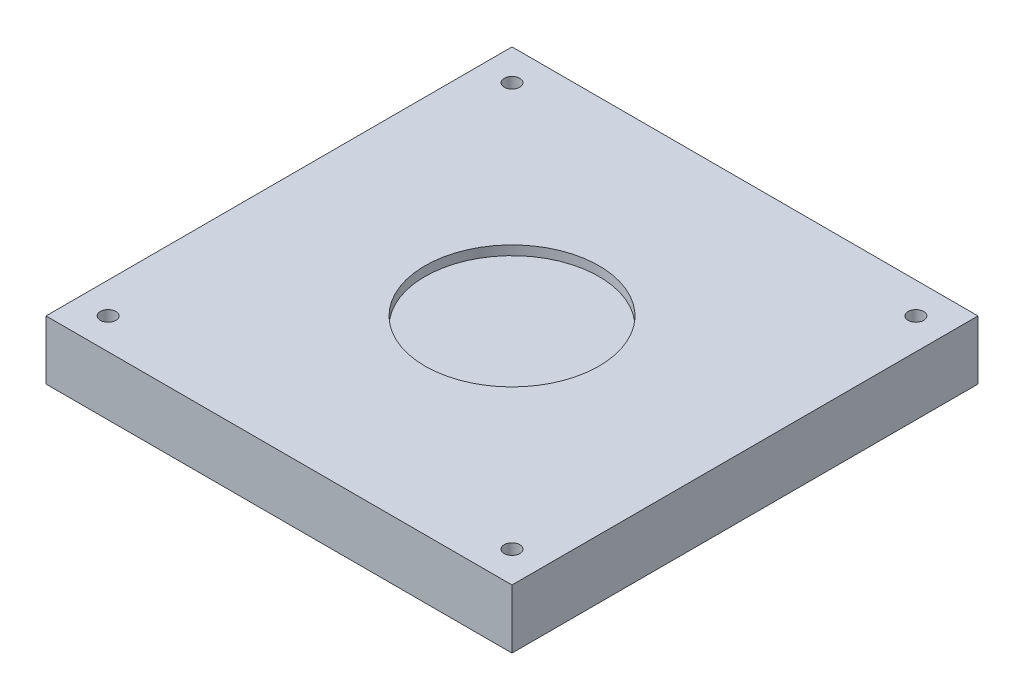
ISO-10303-21;
HEADER;
FILE_DESCRIPTION(('STEP AP214'),'2;1');
FILE_NAME('part.step','',(''),(''),'','','');
FILE_SCHEMA(('AUTOMOTIVE_DESIGN { 1 0 10303 214 1 1 1 1 }'));
ENDSEC;
DATA;
#1=APPLICATION_CONTEXT('core data for automotive mechanical design processes');
#2=APPLICATION_PROTOCOL_DEFINITION('international standard','automotive_design',2000,#1);
#3=PRODUCT_CONTEXT('',#1,'mechanical');
#4=PRODUCT('Part','Part','',(#3));
#5=PRODUCT_RELATED_PRODUCT_CATEGORY('part','',(#4));
#6=PRODUCT_DEFINITION_FORMATION('','',#4);
#7=PRODUCT_DEFINITION_CONTEXT('part definition',#1,'design');
#8=PRODUCT_DEFINITION('design','',#6,#7);
#9=PRODUCT_DEFINITION_SHAPE('','',#8);
#10=(LENGTH_UNIT() NAMED_UNIT(*) SI_UNIT(.MILLI.,.METRE.));
#11=(NAMED_UNIT(*) PLANE_ANGLE_UNIT() SI_UNIT($,.RADIAN.));
#12=(NAMED_UNIT(*) SI_UNIT($,.STERADIAN.) SOLID_ANGLE_UNIT());
#13=UNCERTAINTY_MEASURE_WITH_UNIT(LENGTH_MEASURE(1.E-05),#10,'distance_accuracy_value','');
#14=(GEOMETRIC_REPRESENTATION_CONTEXT(3) GLOBAL_UNCERTAINTY_ASSIGNED_CONTEXT((#13)) GLOBAL_UNIT_ASSIGNED_CONTEXT((#10,
#11,#12)) REPRESENTATION_CONTEXT('',''));
#15=CARTESIAN_POINT('',(0.,0.,0.));
#16=DIRECTION('',(0.,0.,1.));
#17=DIRECTION('',(1.,0.,0.));
#18=AXIS2_PLACEMENT_3D('',#15,#16,#17);
#19=CARTESIAN_POINT('',(0.,19.,0.));
#20=DIRECTION('',(1.,0.,0.));
#21=DIRECTION('',(0.,0.,-1.));
#22=AXIS2_PLACEMENT_3D('',#19,#20,#21);
#23=PLANE('',#22);
#24=DIRECTION('',(0.,0.,1.));
#25=VECTOR('',#24,1.);
#26=CARTESIAN_POINT('',(0.,0.,0.));
#27=LINE('',#26,#25);
#28=CARTESIAN_POINT('',(0.,0.,-150.));
#29=VERTEX_POINT('',#28);
#30=CARTESIAN_POINT('',(0.,0.,0.));
#31=VERTEX_POINT('',#30);
#32=EDGE_CURVE('E107',#29,#31,#27,.T.);
#33=ORIENTED_EDGE('',*,*,#32,.T.);
#34=DIRECTION('',(0.,-1.,0.));
#35=VECTOR('',#34,1.);
#36=CARTESIAN_POINT('',(0.,19.,0.));
#37=LINE('',#36,#35);
#38=CARTESIAN_POINT('',(0.,19.,0.));
#39=VERTEX_POINT('',#38);
#40=EDGE_CURVE('E11',#39,#31,#37,.T.);
#41=ORIENTED_EDGE('',*,*,#40,.F.);
#42=DIRECTION('',(0.,0.,1.));
#43=VECTOR('',#42,1.);
#44=CARTESIAN_POINT('',(0.,19.,0.));
#45=LINE('',#44,#43);
#46=CARTESIAN_POINT('',(0.,19.,-150.));
#47=VERTEX_POINT('',#46);
#48=EDGE_CURVE('E91',#47,#39,#45,.T.);
#49=ORIENTED_EDGE('',*,*,#48,.F.);
#50=DIRECTION('',(0.,-1.,0.));
#51=VECTOR('',#50,1.);
#52=CARTESIAN_POINT('',(0.,19.,-150.));
#53=LINE('',#52,#51);
#54=EDGE_CURVE('E103',#47,#29,#53,.T.);
#55=ORIENTED_EDGE('',*,*,#54,.T.);
#56=EDGE_LOOP('',(#33,#41,#49,#55));
#57=FACE_BOUND('',#56,.T.);
#58=ADVANCED_FACE('F39',(#57),#23,.F.);
#59=CARTESIAN_POINT('',(0.,19.,0.));
#60=DIRECTION('',(0.,0.,-1.));
#61=DIRECTION('',(-1.,0.,0.));
#62=AXIS2_PLACEMENT_3D('',#59,#60,#61);
#63=PLANE('',#62);
#64=DIRECTION('',(1.,0.,0.));
#65=VECTOR('',#64,1.);
#66=CARTESIAN_POINT('',(0.,0.,0.));
#67=LINE('',#66,#65);
#68=CARTESIAN_POINT('',(150.,0.,0.));
#69=VERTEX_POINT('',#68);
#70=EDGE_CURVE('E96',#31,#69,#67,.T.);
#71=ORIENTED_EDGE('',*,*,#70,.T.);
#72=DIRECTION('',(0.,-1.,0.));
#73=VECTOR('',#72,1.);
#74=CARTESIAN_POINT('',(150.,19.,0.));
#75=LINE('',#74,#73);
#76=CARTESIAN_POINT('',(150.,19.,0.));
#77=VERTEX_POINT('',#76);
#78=EDGE_CURVE('E48',#77,#69,#75,.T.);
#79=ORIENTED_EDGE('',*,*,#78,.F.);
#80=DIRECTION('',(1.,0.,0.));
#81=VECTOR('',#80,1.);
#82=CARTESIAN_POINT('',(0.,19.,0.));
#83=LINE('',#82,#81);
#84=EDGE_CURVE('E86',#39,#77,#83,.T.);
#85=ORIENTED_EDGE('',*,*,#84,.F.);
#86=ORIENTED_EDGE('',*,*,#40,.T.);
#87=EDGE_LOOP('',(#71,#79,#85,#86));
#88=FACE_BOUND('',#87,.T.);
#89=ADVANCED_FACE('F95',(#88),#63,.F.);
#90=CARTESIAN_POINT('',(150.,19.,0.));
#91=DIRECTION('',(-1.,0.,0.));
#92=DIRECTION('',(0.,0.,1.));
#93=AXIS2_PLACEMENT_3D('',#90,#91,#92);
#94=PLANE('',#93);
#95=DIRECTION('',(0.,0.,-1.));
#96=VECTOR('',#95,1.);
#97=CARTESIAN_POINT('',(150.,0.,0.));
#98=LINE('',#97,#96);
#99=CARTESIAN_POINT('',(150.,0.,-150.));
#100=VERTEX_POINT('',#99);
#101=EDGE_CURVE('E73',#69,#100,#98,.T.);
#102=ORIENTED_EDGE('',*,*,#101,.T.);
#103=DIRECTION('',(0.,-1.,0.));
#104=VECTOR('',#103,1.);
#105=CARTESIAN_POINT('',(150.,19.,-150.));
#106=LINE('',#105,#104);
#107=CARTESIAN_POINT('',(150.,19.,-150.));
#108=VERTEX_POINT('',#107);
#109=EDGE_CURVE('E98',#108,#100,#106,.T.);
#110=ORIENTED_EDGE('',*,*,#109,.F.);
#111=DIRECTION('',(0.,0.,-1.));
#112=VECTOR('',#111,1.);
#113=CARTESIAN_POINT('',(150.,19.,0.));
#114=LINE('',#113,#112);
#115=EDGE_CURVE('E89',#77,#108,#114,.T.);
#116=ORIENTED_EDGE('',*,*,#115,.F.);
#117=ORIENTED_EDGE('',*,*,#78,.T.);
#118=EDGE_LOOP('',(#102,#110,#116,#117));
#119=FACE_BOUND('',#118,.T.);
#120=ADVANCED_FACE('F99',(#119),#94,.F.);
#121=CARTESIAN_POINT('',(0.,19.,-150.));
#122=DIRECTION('',(0.,0.,1.));
#123=DIRECTION('',(1.,0.,0.));
#124=AXIS2_PLACEMENT_3D('',#121,#122,#123);
#125=PLANE('',#124);
#126=DIRECTION('',(-1.,0.,0.));
#127=VECTOR('',#126,1.);
#128=CARTESIAN_POINT('',(0.,0.,-150.));
#129=LINE('',#128,#127);
#130=EDGE_CURVE('E79',#100,#29,#129,.T.);
#131=ORIENTED_EDGE('',*,*,#130,.T.);
#132=ORIENTED_EDGE('',*,*,#54,.F.);
#133=DIRECTION('',(-1.,0.,0.));
#134=VECTOR('',#133,1.);
#135=CARTESIAN_POINT('',(0.,19.,-150.));
#136=LINE('',#135,#134);
#137=EDGE_CURVE('E56',#108,#47,#136,.T.);
#138=ORIENTED_EDGE('',*,*,#137,.F.);
#139=ORIENTED_EDGE('',*,*,#109,.T.);
#140=EDGE_LOOP('',(#131,#132,#138,#139));
#141=FACE_BOUND('',#140,.T.);
#142=ADVANCED_FACE('F121',(#141),#125,.F.);
#143=CARTESIAN_POINT('',(0.,19.,0.));
#144=DIRECTION('',(0.,-1.,0.));
#145=DIRECTION('',(0.,0.,-1.));
#146=AXIS2_PLACEMENT_3D('',#143,#144,#145);
#147=PLANE('',#146);
#148=CARTESIAN_POINT('',(10.,19.,-10.));
#149=DIRECTION('',(0.,1.,0.));
#150=DIRECTION('',(0.,0.,-1.));
#151=AXIS2_PLACEMENT_3D('',#148,#149,#150);
#152=CIRCLE('',#151,2.5);
#153=CARTESIAN_POINT('',(10.,19.,-12.5));
#154=VERTEX_POINT('',#153);
#155=EDGE_CURVE('E144',#154,#154,#152,.T.);
#156=ORIENTED_EDGE('',*,*,#155,.F.);
#157=EDGE_LOOP('',(#156));
#158=FACE_BOUND('',#157,.T.);
#159=CARTESIAN_POINT('',(140.,19.,-10.));
#160=DIRECTION('',(0.,1.,0.));
#161=DIRECTION('',(0.,0.,1.));
#162=AXIS2_PLACEMENT_3D('',#159,#160,#161);
#163=CIRCLE('',#162,2.50000000000002);
#164=CARTESIAN_POINT('',(140.,19.,-7.49999999999999));
#165=VERTEX_POINT('',#164);
#166=EDGE_CURVE('E152',#165,#165,#163,.T.);
#167=ORIENTED_EDGE('',*,*,#166,.F.);
#168=EDGE_LOOP('',(#167));
#169=FACE_BOUND('',#168,.T.);
#170=CARTESIAN_POINT('',(140.,19.,-140.));
#171=DIRECTION('',(0.,1.,0.));
#172=DIRECTION('',(0.,0.,-1.));
#173=AXIS2_PLACEMENT_3D('',#170,#171,#172);
#174=CIRCLE('',#173,2.50000000000002);
#175=CARTESIAN_POINT('',(140.,19.,-142.5));
#176=VERTEX_POINT('',#175);
#177=EDGE_CURVE('E160',#176,#176,#174,.T.);
#178=ORIENTED_EDGE('',*,*,#177,.F.);
#179=EDGE_LOOP('',(#178));
#180=FACE_BOUND('',#179,.T.);
#181=CARTESIAN_POINT('',(10.,19.,-140.));
#182=DIRECTION('',(0.,1.,0.));
#183=DIRECTION('',(0.,0.,1.));
#184=AXIS2_PLACEMENT_3D('',#181,#182,#183);
#185=CIRCLE('',#184,2.5);
#186=CARTESIAN_POINT('',(10.,19.,-137.5));
#187=VERTEX_POINT('',#186);
#188=EDGE_CURVE('E136',#187,#187,#185,.T.);
#189=ORIENTED_EDGE('',*,*,#188,.F.);
#190=EDGE_LOOP('',(#189));
#191=FACE_BOUND('',#190,.T.);
#192=CARTESIAN_POINT('',(75.,19.,-75.));
#193=DIRECTION('',(0.,1.,0.));
#194=DIRECTION('',(0.,0.,1.));
#195=AXIS2_PLACEMENT_3D('',#192,#193,#194);
#196=CIRCLE('',#195,28.);
#197=CARTESIAN_POINT('',(75.,19.,-47.));
#198=VERTEX_POINT('',#197);
#199=EDGE_CURVE('E128',#198,#198,#196,.T.);
#200=ORIENTED_EDGE('',*,*,#199,.F.);
#201=EDGE_LOOP('',(#200));
#202=FACE_BOUND('',#201,.T.);
#203=ORIENTED_EDGE('',*,*,#48,.T.);
#204=ORIENTED_EDGE('',*,*,#84,.T.);
#205=ORIENTED_EDGE('',*,*,#115,.T.);
#206=ORIENTED_EDGE('',*,*,#137,.T.);
#207=EDGE_LOOP('',(#203,#204,#205,#206));
#208=FACE_BOUND('',#207,.T.);
#209=ADVANCED_FACE('F87',(#158,#169,#180,#191,#202,#208),#147,.F.);
#210=CARTESIAN_POINT('',(0.,0.,0.));
#211=DIRECTION('',(0.,-1.,0.));
#212=DIRECTION('',(0.,0.,-1.));
#213=AXIS2_PLACEMENT_3D('',#210,#211,#212);
#214=PLANE('',#213);
#215=ORIENTED_EDGE('',*,*,#32,.F.);
#216=ORIENTED_EDGE('',*,*,#130,.F.);
#217=ORIENTED_EDGE('',*,*,#101,.F.);
#218=ORIENTED_EDGE('',*,*,#70,.F.);
#219=EDGE_LOOP('',(#215,#216,#217,#218));
#220=FACE_BOUND('',#219,.T.);
#221=ADVANCED_FACE('F124',(#220),#214,.T.);
#222=CARTESIAN_POINT('',(75.,16.,-75.));
#223=DIRECTION('',(0.,1.,0.));
#224=DIRECTION('',(0.,0.,1.));
#225=AXIS2_PLACEMENT_3D('',#222,#223,#224);
#226=CYLINDRICAL_SURFACE('',#225,28.);
#227=CARTESIAN_POINT('',(75.,16.,-75.));
#228=DIRECTION('',(0.,1.,0.));
#229=DIRECTION('',(0.,0.,1.));
#230=AXIS2_PLACEMENT_3D('',#227,#228,#229);
#231=CIRCLE('',#230,28.);
#232=CARTESIAN_POINT('',(75.,16.,-47.));
#233=VERTEX_POINT('',#232);
#234=EDGE_CURVE('E111',#233,#233,#231,.T.);
#235=ORIENTED_EDGE('',*,*,#234,.F.);
#236=EDGE_LOOP('',(#235));
#237=FACE_BOUND('',#236,.T.);
#238=ORIENTED_EDGE('',*,*,#199,.T.);
#239=EDGE_LOOP('',(#238));
#240=FACE_BOUND('',#239,.T.);
#241=ADVANCED_FACE('F185',(#237,#240),#226,.F.);
#242=CARTESIAN_POINT('',(75.,16.,-75.));
#243=DIRECTION('',(0.,1.,0.));
#244=DIRECTION('',(0.,0.,1.));
#245=AXIS2_PLACEMENT_3D('',#242,#243,#244);
#246=PLANE('',#245);
#247=ORIENTED_EDGE('',*,*,#234,.T.);
#248=EDGE_LOOP('',(#247));
#249=FACE_BOUND('',#248,.T.);
#250=ADVANCED_FACE('F187',(#249),#246,.T.);
#251=CARTESIAN_POINT('',(10.,12.65,-140.));
#252=DIRECTION('',(0.,1.,0.));
#253=DIRECTION('',(0.,0.,1.));
#254=AXIS2_PLACEMENT_3D('',#251,#252,#253);
#255=CYLINDRICAL_SURFACE('',#254,2.5);
#256=CARTESIAN_POINT('',(10.,12.65,-140.));
#257=DIRECTION('',(0.,1.,0.));
#258=DIRECTION('',(0.,0.,1.));
#259=AXIS2_PLACEMENT_3D('',#256,#257,#258);
#260=CIRCLE('',#259,2.5);
#261=CARTESIAN_POINT('',(10.,12.65,-137.5));
#262=VERTEX_POINT('',#261);
#263=EDGE_CURVE('E132',#262,#262,#260,.T.);
#264=ORIENTED_EDGE('',*,*,#263,.F.);
#265=EDGE_LOOP('',(#264));
#266=FACE_BOUND('',#265,.T.);
#267=ORIENTED_EDGE('',*,*,#188,.T.);
#268=EDGE_LOOP('',(#267));
#269=FACE_BOUND('',#268,.T.);
#270=ADVANCED_FACE('F194',(#266,#269),#255,.F.);
#271=CARTESIAN_POINT('',(10.,12.65,-140.));
#272=DIRECTION('',(0.,1.,0.));
#273=DIRECTION('',(0.,0.,1.));
#274=AXIS2_PLACEMENT_3D('',#271,#272,#273);
#275=PLANE('',#274);
#276=ORIENTED_EDGE('',*,*,#263,.T.);
#277=EDGE_LOOP('',(#276));
#278=FACE_BOUND('',#277,.T.);
#279=ADVANCED_FACE('F173',(#278),#275,.T.);
#280=CARTESIAN_POINT('',(140.,12.65,-140.));
#281=DIRECTION('',(0.,1.,0.));
#282=DIRECTION('',(0.,0.,1.));
#283=AXIS2_PLACEMENT_3D('',#280,#281,#282);
#284=CYLINDRICAL_SURFACE('',#283,2.50000000000002);
#285=CARTESIAN_POINT('',(140.,12.65,-140.));
#286=DIRECTION('',(0.,1.,0.));
#287=DIRECTION('',(0.,0.,-1.));
#288=AXIS2_PLACEMENT_3D('',#285,#286,#287);
#289=CIRCLE('',#288,2.50000000000002);
#290=CARTESIAN_POINT('',(140.,12.65,-142.5));
#291=VERTEX_POINT('',#290);
#292=EDGE_CURVE('E140',#291,#291,#289,.T.);
#293=ORIENTED_EDGE('',*,*,#292,.F.);
#294=EDGE_LOOP('',(#293));
#295=FACE_BOUND('',#294,.T.);
#296=ORIENTED_EDGE('',*,*,#177,.T.);
#297=EDGE_LOOP('',(#296));
#298=FACE_BOUND('',#297,.T.);
#299=ADVANCED_FACE('F170',(#295,#298),#284,.F.);
#300=CARTESIAN_POINT('',(140.,12.65,-140.));
#301=DIRECTION('',(0.,-1.,0.));
#302=DIRECTION('',(0.,0.,-1.));
#303=AXIS2_PLACEMENT_3D('',#300,#301,#302);
#304=PLANE('',#303);
#305=ORIENTED_EDGE('',*,*,#292,.T.);
#306=EDGE_LOOP('',(#305));
#307=FACE_BOUND('',#306,.T.);
#308=ADVANCED_FACE('F168',(#307),#304,.F.);
#309=CARTESIAN_POINT('',(140.,12.65,-10.));
#310=DIRECTION('',(0.,1.,0.));
#311=DIRECTION('',(0.,0.,1.));
#312=AXIS2_PLACEMENT_3D('',#309,#310,#311);
#313=CYLINDRICAL_SURFACE('',#312,2.50000000000002);
#314=CARTESIAN_POINT('',(140.,12.65,-10.));
#315=DIRECTION('',(0.,1.,0.));
#316=DIRECTION('',(0.,0.,1.));
#317=AXIS2_PLACEMENT_3D('',#314,#315,#316);
#318=CIRCLE('',#317,2.50000000000002);
#319=CARTESIAN_POINT('',(140.,12.65,-7.49999999999999));
#320=VERTEX_POINT('',#319);
#321=EDGE_CURVE('E156',#320,#320,#318,.T.);
#322=ORIENTED_EDGE('',*,*,#321,.F.);
#323=EDGE_LOOP('',(#322));
#324=FACE_BOUND('',#323,.T.);
#325=ORIENTED_EDGE('',*,*,#166,.T.);
#326=EDGE_LOOP('',(#325));
#327=FACE_BOUND('',#326,.T.);
#328=ADVANCED_FACE('F257',(#324,#327),#313,.F.);
#329=CARTESIAN_POINT('',(140.,12.65,-10.));
#330=DIRECTION('',(0.,1.,0.));
#331=DIRECTION('',(0.,0.,1.));
#332=AXIS2_PLACEMENT_3D('',#329,#330,#331);
#333=PLANE('',#332);
#334=ORIENTED_EDGE('',*,*,#321,.T.);
#335=EDGE_LOOP('',(#334));
#336=FACE_BOUND('',#335,.T.);
#337=ADVANCED_FACE('F264',(#336),#333,.T.);
#338=CARTESIAN_POINT('',(10.,12.65,-10.));
#339=DIRECTION('',(0.,1.,0.));
#340=DIRECTION('',(0.,0.,1.));
#341=AXIS2_PLACEMENT_3D('',#338,#339,#340);
#342=CYLINDRICAL_SURFACE('',#341,2.5);
#343=CARTESIAN_POINT('',(10.,12.65,-10.));
#344=DIRECTION('',(0.,1.,0.));
#345=DIRECTION('',(0.,0.,-1.));
#346=AXIS2_PLACEMENT_3D('',#343,#344,#345);
#347=CIRCLE('',#346,2.5);
#348=CARTESIAN_POINT('',(10.,12.65,-12.5));
#349=VERTEX_POINT('',#348);
#350=EDGE_CURVE('E148',#349,#349,#347,.T.);
#351=ORIENTED_EDGE('',*,*,#350,.F.);
#352=EDGE_LOOP('',(#351));
#353=FACE_BOUND('',#352,.T.);
#354=ORIENTED_EDGE('',*,*,#155,.T.);
#355=EDGE_LOOP('',(#354));
#356=FACE_BOUND('',#355,.T.);
#357=ADVANCED_FACE('F272',(#353,#356),#342,.F.);
#358=CARTESIAN_POINT('',(10.,12.65,-10.));
#359=DIRECTION('',(0.,-1.,0.));
#360=DIRECTION('',(0.,0.,-1.));
#361=AXIS2_PLACEMENT_3D('',#358,#359,#360);
#362=PLANE('',#361);
#363=ORIENTED_EDGE('',*,*,#350,.T.);
#364=EDGE_LOOP('',(#363));
#365=FACE_BOUND('',#364,.T.);
#366=ADVANCED_FACE('F280',(#365),#362,.F.);
#367=CLOSED_SHELL('',(#58,#89,#120,#142,#209,#221,#241,#250,#270,#279,#299,#308,#328,#337,#357,#366));
#368=MANIFOLD_SOLID_BREP('B2',#367);
#369=ADVANCED_BREP_SHAPE_REPRESENTATION('',(#18,#368),#14);
#370=SHAPE_DEFINITION_REPRESENTATION(#9,#369);
ENDSEC;
END-ISO-10303-21;
